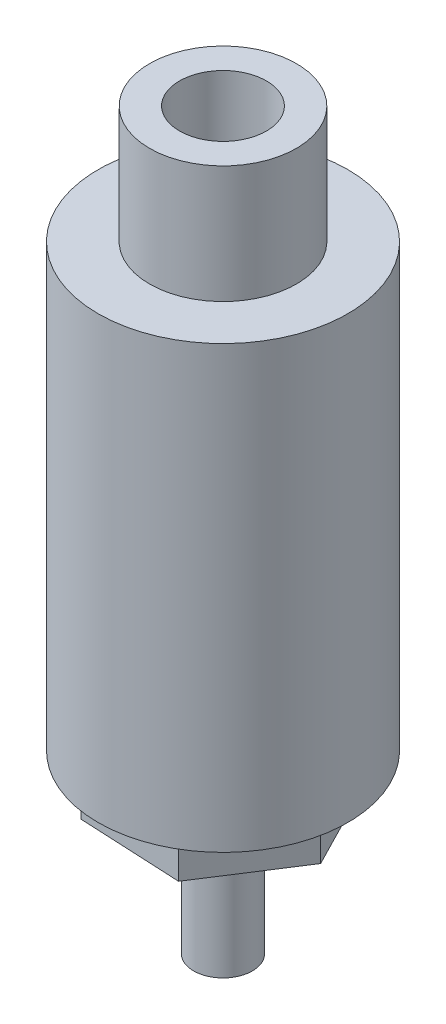
ISO-10303-21;
HEADER;
FILE_DESCRIPTION(('STEP AP214'),'2;1');
FILE_NAME('part.step','',(''),(''),'','','');
FILE_SCHEMA(('AUTOMOTIVE_DESIGN { 1 0 10303 214 1 1 1 1 }'));
ENDSEC;
DATA;
#1=APPLICATION_CONTEXT('core data for automotive mechanical design processes');
#2=APPLICATION_PROTOCOL_DEFINITION('international standard','automotive_design',2000,#1);
#3=PRODUCT_CONTEXT('',#1,'mechanical');
#4=PRODUCT('Part','Part','',(#3));
#5=PRODUCT_RELATED_PRODUCT_CATEGORY('part','',(#4));
#6=PRODUCT_DEFINITION_FORMATION('','',#4);
#7=PRODUCT_DEFINITION_CONTEXT('part definition',#1,'design');
#8=PRODUCT_DEFINITION('design','',#6,#7);
#9=PRODUCT_DEFINITION_SHAPE('','',#8);
#10=(LENGTH_UNIT() NAMED_UNIT(*) SI_UNIT(.MILLI.,.METRE.));
#11=(NAMED_UNIT(*) PLANE_ANGLE_UNIT() SI_UNIT($,.RADIAN.));
#12=(NAMED_UNIT(*) SI_UNIT($,.STERADIAN.) SOLID_ANGLE_UNIT());
#13=UNCERTAINTY_MEASURE_WITH_UNIT(LENGTH_MEASURE(1.E-05),#10,'distance_accuracy_value','');
#14=(GEOMETRIC_REPRESENTATION_CONTEXT(3) GLOBAL_UNCERTAINTY_ASSIGNED_CONTEXT((#13)) GLOBAL_UNIT_ASSIGNED_CONTEXT((#10,
#11,#12)) REPRESENTATION_CONTEXT('',''));
#15=CARTESIAN_POINT('',(0.,0.,0.));
#16=DIRECTION('',(0.,0.,1.));
#17=DIRECTION('',(1.,0.,0.));
#18=AXIS2_PLACEMENT_3D('',#15,#16,#17);
#19=CARTESIAN_POINT('',(8.5,0.,0.));
#20=DIRECTION('',(0.,1.,0.));
#21=DIRECTION('',(0.,0.,1.));
#22=AXIS2_PLACEMENT_3D('',#19,#20,#21);
#23=PLANE('',#22);
#24=CARTESIAN_POINT('',(0.,0.,0.));
#25=DIRECTION('',(0.,-1.,0.));
#26=DIRECTION('',(0.,0.,-1.));
#27=AXIS2_PLACEMENT_3D('',#24,#25,#26);
#28=CIRCLE('',#27,8.5);
#29=CARTESIAN_POINT('',(0.,0.,-8.5));
#30=VERTEX_POINT('',#29);
#31=EDGE_CURVE('E11',#30,#30,#28,.T.);
#32=ORIENTED_EDGE('',*,*,#31,.F.);
#33=EDGE_LOOP('',(#32));
#34=FACE_BOUND('',#33,.T.);
#35=CARTESIAN_POINT('',(0.,0.,0.));
#36=DIRECTION('',(0.,1.,0.));
#37=DIRECTION('',(0.,0.,1.));
#38=AXIS2_PLACEMENT_3D('',#35,#36,#37);
#39=CIRCLE('',#38,5.);
#40=CARTESIAN_POINT('',(0.,0.,5.));
#41=VERTEX_POINT('',#40);
#42=EDGE_CURVE('E220',#41,#41,#39,.T.);
#43=ORIENTED_EDGE('',*,*,#42,.F.);
#44=EDGE_LOOP('',(#43));
#45=FACE_BOUND('',#44,.T.);
#46=ADVANCED_FACE('F33',(#34,#45),#23,.T.);
#47=CARTESIAN_POINT('',(0.,-30.,0.));
#48=DIRECTION('',(0.,-1.,0.));
#49=DIRECTION('',(0.,0.,-1.));
#50=AXIS2_PLACEMENT_3D('',#47,#48,#49);
#51=PLANE('',#50);
#52=CARTESIAN_POINT('',(0.,-30.,0.));
#53=DIRECTION('',(0.,-1.,0.));
#54=DIRECTION('',(0.,0.,-1.));
#55=AXIS2_PLACEMENT_3D('',#52,#53,#54);
#56=CIRCLE('',#55,8.5);
#57=CARTESIAN_POINT('',(0.,-30.,-8.5));
#58=VERTEX_POINT('',#57);
#59=EDGE_CURVE('E41',#58,#58,#56,.T.);
#60=ORIENTED_EDGE('',*,*,#59,.T.);
#61=EDGE_LOOP('',(#60));
#62=FACE_BOUND('',#61,.T.);
#63=DIRECTION('',(0.541810394297245,0.,-0.840500741600782));
#64=VECTOR('',#63,1.);
#65=CARTESIAN_POINT('',(-3.19892857884121,-30.,-6.22630355407388));
#66=LINE('',#65,#64);
#67=CARTESIAN_POINT('',(-6.99160133892192,-30.,-0.342798362868405));
#68=VERTEX_POINT('',#67);
#69=CARTESIAN_POINT('',(-3.19892857884121,-30.,-6.22630355407388));
#70=VERTEX_POINT('',#69);
#71=EDGE_CURVE('E122',#68,#70,#66,.T.);
#72=ORIENTED_EDGE('',*,*,#71,.F.);
#73=DIRECTION('',(-0.456989796977315,0.,-0.889471936296268));
#74=VECTOR('',#73,1.);
#75=CARTESIAN_POINT('',(-6.99160133892192,-30.,-0.342798362868405));
#76=LINE('',#75,#74);
#77=CARTESIAN_POINT('',(-3.79267276008071,-30.,5.88350519120548));
#78=VERTEX_POINT('',#77);
#79=EDGE_CURVE('E119',#78,#68,#76,.T.);
#80=ORIENTED_EDGE('',*,*,#79,.F.);
#81=DIRECTION('',(-0.99880019127456,0.,-0.0489711946954855));
#82=VECTOR('',#81,1.);
#83=CARTESIAN_POINT('',(-3.79267276008071,-30.,5.88350519120548));
#84=LINE('',#83,#82);
#85=CARTESIAN_POINT('',(3.19892857884121,-30.,6.22630355407388));
#86=VERTEX_POINT('',#85);
#87=EDGE_CURVE('E77',#86,#78,#84,.T.);
#88=ORIENTED_EDGE('',*,*,#87,.F.);
#89=DIRECTION('',(-0.541810394297244,0.,0.840500741600782));
#90=VECTOR('',#89,1.);
#91=CARTESIAN_POINT('',(3.19892857884121,-30.,6.22630355407388));
#92=LINE('',#91,#90);
#93=CARTESIAN_POINT('',(6.99160133892192,-30.,0.342798362868401));
#94=VERTEX_POINT('',#93);
#95=EDGE_CURVE('E128',#94,#86,#92,.T.);
#96=ORIENTED_EDGE('',*,*,#95,.F.);
#97=DIRECTION('',(0.456989796977315,0.,0.889471936296268));
#98=VECTOR('',#97,1.);
#99=CARTESIAN_POINT('',(6.99160133892192,-30.,0.342798362868401));
#100=LINE('',#99,#98);
#101=CARTESIAN_POINT('',(3.79267276008071,-30.,-5.88350519120548));
#102=VERTEX_POINT('',#101);
#103=EDGE_CURVE('E108',#102,#94,#100,.T.);
#104=ORIENTED_EDGE('',*,*,#103,.F.);
#105=DIRECTION('',(0.99880019127456,0.,0.0489711946954854));
#106=VECTOR('',#105,1.);
#107=CARTESIAN_POINT('',(3.79267276008071,-30.,-5.88350519120548));
#108=LINE('',#107,#106);
#109=EDGE_CURVE('E125',#70,#102,#108,.T.);
#110=ORIENTED_EDGE('',*,*,#109,.F.);
#111=EDGE_LOOP('',(#72,#80,#88,#96,#104,#110));
#112=FACE_BOUND('',#111,.T.);
#113=ADVANCED_FACE('F142',(#62,#112),#51,.T.);
#114=CARTESIAN_POINT('',(0.,0.,0.));
#115=DIRECTION('',(0.,-1.,0.));
#116=DIRECTION('',(0.,0.,-1.));
#117=AXIS2_PLACEMENT_3D('',#114,#115,#116);
#118=CYLINDRICAL_SURFACE('',#117,8.5);
#119=ORIENTED_EDGE('',*,*,#31,.T.);
#120=EDGE_LOOP('',(#119));
#121=FACE_BOUND('',#120,.T.);
#122=ORIENTED_EDGE('',*,*,#59,.F.);
#123=EDGE_LOOP('',(#122));
#124=FACE_BOUND('',#123,.T.);
#125=ADVANCED_FACE('F35',(#121,#124),#118,.T.);
#126=CARTESIAN_POINT('',(-6.99160133892192,-33.,-0.342798362868405));
#127=DIRECTION('',(0.889471936296268,0.,-0.456989796977315));
#128=DIRECTION('',(-0.456989796977315,0.,-0.889471936296268));
#129=AXIS2_PLACEMENT_3D('',#126,#127,#128);
#130=PLANE('',#129);
#131=ORIENTED_EDGE('',*,*,#79,.T.);
#132=DIRECTION('',(0.,1.,0.));
#133=VECTOR('',#132,1.);
#134=CARTESIAN_POINT('',(-6.99160133892192,-33.,-0.342798362868405));
#135=LINE('',#134,#133);
#136=CARTESIAN_POINT('',(-6.99160133892192,-33.,-0.342798362868405));
#137=VERTEX_POINT('',#136);
#138=EDGE_CURVE('E138',#137,#68,#135,.T.);
#139=ORIENTED_EDGE('',*,*,#138,.F.);
#140=DIRECTION('',(-0.456989796977315,0.,-0.889471936296268));
#141=VECTOR('',#140,1.);
#142=CARTESIAN_POINT('',(-6.99160133892192,-33.,-0.342798362868405));
#143=LINE('',#142,#141);
#144=CARTESIAN_POINT('',(-3.79267276008071,-33.,5.88350519120548));
#145=VERTEX_POINT('',#144);
#146=EDGE_CURVE('E131',#145,#137,#143,.T.);
#147=ORIENTED_EDGE('',*,*,#146,.F.);
#148=DIRECTION('',(0.,1.,0.));
#149=VECTOR('',#148,1.);
#150=CARTESIAN_POINT('',(-3.79267276008071,-33.,5.88350519120548));
#151=LINE('',#150,#149);
#152=EDGE_CURVE('E115',#145,#78,#151,.T.);
#153=ORIENTED_EDGE('',*,*,#152,.T.);
#154=EDGE_LOOP('',(#131,#139,#147,#153));
#155=FACE_BOUND('',#154,.T.);
#156=ADVANCED_FACE('F146',(#155),#130,.F.);
#157=CARTESIAN_POINT('',(-3.19892857884121,-33.,-6.22630355407388));
#158=DIRECTION('',(0.840500741600782,0.,0.541810394297245));
#159=DIRECTION('',(0.541810394297245,0.,-0.840500741600782));
#160=AXIS2_PLACEMENT_3D('',#157,#158,#159);
#161=PLANE('',#160);
#162=ORIENTED_EDGE('',*,*,#71,.T.);
#163=DIRECTION('',(0.,1.,0.));
#164=VECTOR('',#163,1.);
#165=CARTESIAN_POINT('',(-3.19892857884121,-33.,-6.22630355407388));
#166=LINE('',#165,#164);
#167=CARTESIAN_POINT('',(-3.19892857884121,-33.,-6.22630355407388));
#168=VERTEX_POINT('',#167);
#169=EDGE_CURVE('E135',#168,#70,#166,.T.);
#170=ORIENTED_EDGE('',*,*,#169,.F.);
#171=DIRECTION('',(0.541810394297245,0.,-0.840500741600782));
#172=VECTOR('',#171,1.);
#173=CARTESIAN_POINT('',(-3.19892857884121,-33.,-6.22630355407388));
#174=LINE('',#173,#172);
#175=EDGE_CURVE('E85',#137,#168,#174,.T.);
#176=ORIENTED_EDGE('',*,*,#175,.F.);
#177=ORIENTED_EDGE('',*,*,#138,.T.);
#178=EDGE_LOOP('',(#162,#170,#176,#177));
#179=FACE_BOUND('',#178,.T.);
#180=ADVANCED_FACE('F152',(#179),#161,.F.);
#181=CARTESIAN_POINT('',(3.79267276008071,-33.,-5.88350519120548));
#182=DIRECTION('',(-0.0489711946954854,0.,0.99880019127456));
#183=DIRECTION('',(0.99880019127456,0.,0.0489711946954854));
#184=AXIS2_PLACEMENT_3D('',#181,#182,#183);
#185=PLANE('',#184);
#186=ORIENTED_EDGE('',*,*,#109,.T.);
#187=DIRECTION('',(0.,1.,0.));
#188=VECTOR('',#187,1.);
#189=CARTESIAN_POINT('',(3.79267276008071,-33.,-5.88350519120548));
#190=LINE('',#189,#188);
#191=CARTESIAN_POINT('',(3.79267276008071,-33.,-5.88350519120548));
#192=VERTEX_POINT('',#191);
#193=EDGE_CURVE('E111',#192,#102,#190,.T.);
#194=ORIENTED_EDGE('',*,*,#193,.F.);
#195=DIRECTION('',(0.99880019127456,0.,0.0489711946954854));
#196=VECTOR('',#195,1.);
#197=CARTESIAN_POINT('',(3.79267276008071,-33.,-5.88350519120548));
#198=LINE('',#197,#196);
#199=EDGE_CURVE('E99',#168,#192,#198,.T.);
#200=ORIENTED_EDGE('',*,*,#199,.F.);
#201=ORIENTED_EDGE('',*,*,#169,.T.);
#202=EDGE_LOOP('',(#186,#194,#200,#201));
#203=FACE_BOUND('',#202,.T.);
#204=ADVANCED_FACE('F165',(#203),#185,.F.);
#205=CARTESIAN_POINT('',(6.99160133892192,-33.,0.342798362868401));
#206=DIRECTION('',(-0.889471936296268,0.,0.456989796977315));
#207=DIRECTION('',(0.456989796977315,0.,0.889471936296268));
#208=AXIS2_PLACEMENT_3D('',#205,#206,#207);
#209=PLANE('',#208);
#210=ORIENTED_EDGE('',*,*,#103,.T.);
#211=DIRECTION('',(0.,1.,0.));
#212=VECTOR('',#211,1.);
#213=CARTESIAN_POINT('',(6.99160133892192,-33.,0.342798362868401));
#214=LINE('',#213,#212);
#215=CARTESIAN_POINT('',(6.99160133892192,-33.,0.342798362868401));
#216=VERTEX_POINT('',#215);
#217=EDGE_CURVE('E105',#216,#94,#214,.T.);
#218=ORIENTED_EDGE('',*,*,#217,.F.);
#219=DIRECTION('',(0.456989796977315,0.,0.889471936296268));
#220=VECTOR('',#219,1.);
#221=CARTESIAN_POINT('',(6.99160133892192,-33.,0.342798362868401));
#222=LINE('',#221,#220);
#223=EDGE_CURVE('E93',#192,#216,#222,.T.);
#224=ORIENTED_EDGE('',*,*,#223,.F.);
#225=ORIENTED_EDGE('',*,*,#193,.T.);
#226=EDGE_LOOP('',(#210,#218,#224,#225));
#227=FACE_BOUND('',#226,.T.);
#228=ADVANCED_FACE('F106',(#227),#209,.F.);
#229=CARTESIAN_POINT('',(3.19892857884121,-33.,6.22630355407388));
#230=DIRECTION('',(-0.840500741600782,0.,-0.541810394297244));
#231=DIRECTION('',(-0.541810394297244,0.,0.840500741600782));
#232=AXIS2_PLACEMENT_3D('',#229,#230,#231);
#233=PLANE('',#232);
#234=ORIENTED_EDGE('',*,*,#95,.T.);
#235=DIRECTION('',(0.,1.,0.));
#236=VECTOR('',#235,1.);
#237=CARTESIAN_POINT('',(3.19892857884121,-33.,6.22630355407388));
#238=LINE('',#237,#236);
#239=CARTESIAN_POINT('',(3.19892857884121,-33.,6.22630355407388));
#240=VERTEX_POINT('',#239);
#241=EDGE_CURVE('E48',#240,#86,#238,.T.);
#242=ORIENTED_EDGE('',*,*,#241,.F.);
#243=DIRECTION('',(-0.541810394297244,0.,0.840500741600782));
#244=VECTOR('',#243,1.);
#245=CARTESIAN_POINT('',(3.19892857884121,-33.,6.22630355407388));
#246=LINE('',#245,#244);
#247=EDGE_CURVE('E97',#216,#240,#246,.T.);
#248=ORIENTED_EDGE('',*,*,#247,.F.);
#249=ORIENTED_EDGE('',*,*,#217,.T.);
#250=EDGE_LOOP('',(#234,#242,#248,#249));
#251=FACE_BOUND('',#250,.T.);
#252=ADVANCED_FACE('F113',(#251),#233,.F.);
#253=CARTESIAN_POINT('',(-3.79267276008071,-33.,5.88350519120548));
#254=DIRECTION('',(0.0489711946954855,0.,-0.99880019127456));
#255=DIRECTION('',(-0.99880019127456,0.,-0.0489711946954855));
#256=AXIS2_PLACEMENT_3D('',#253,#254,#255);
#257=PLANE('',#256);
#258=ORIENTED_EDGE('',*,*,#87,.T.);
#259=ORIENTED_EDGE('',*,*,#152,.F.);
#260=DIRECTION('',(-0.99880019127456,0.,-0.0489711946954855));
#261=VECTOR('',#260,1.);
#262=CARTESIAN_POINT('',(-3.79267276008071,-33.,5.88350519120548));
#263=LINE('',#262,#261);
#264=EDGE_CURVE('E56',#240,#145,#263,.T.);
#265=ORIENTED_EDGE('',*,*,#264,.F.);
#266=ORIENTED_EDGE('',*,*,#241,.T.);
#267=EDGE_LOOP('',(#258,#259,#265,#266));
#268=FACE_BOUND('',#267,.T.);
#269=ADVANCED_FACE('F173',(#268),#257,.F.);
#270=CARTESIAN_POINT('',(0.,-33.,0.));
#271=DIRECTION('',(0.,1.,0.));
#272=DIRECTION('',(0.,0.,1.));
#273=AXIS2_PLACEMENT_3D('',#270,#271,#272);
#274=PLANE('',#273);
#275=CARTESIAN_POINT('',(0.,-33.,0.));
#276=DIRECTION('',(0.,-1.,0.));
#277=DIRECTION('',(0.,0.,-1.));
#278=AXIS2_PLACEMENT_3D('',#275,#276,#277);
#279=CIRCLE('',#278,2.);
#280=CARTESIAN_POINT('',(0.,-33.,-2.));
#281=VERTEX_POINT('',#280);
#282=EDGE_CURVE('E217',#281,#281,#279,.T.);
#283=ORIENTED_EDGE('',*,*,#282,.F.);
#284=EDGE_LOOP('',(#283));
#285=FACE_BOUND('',#284,.T.);
#286=ORIENTED_EDGE('',*,*,#146,.T.);
#287=ORIENTED_EDGE('',*,*,#175,.T.);
#288=ORIENTED_EDGE('',*,*,#199,.T.);
#289=ORIENTED_EDGE('',*,*,#223,.T.);
#290=ORIENTED_EDGE('',*,*,#247,.T.);
#291=ORIENTED_EDGE('',*,*,#264,.T.);
#292=EDGE_LOOP('',(#286,#287,#288,#289,#290,#291));
#293=FACE_BOUND('',#292,.T.);
#294=ADVANCED_FACE('F95',(#285,#293),#274,.F.);
#295=CARTESIAN_POINT('',(0.,8.,0.));
#296=DIRECTION('',(0.,-1.,0.));
#297=DIRECTION('',(0.,0.,-1.));
#298=AXIS2_PLACEMENT_3D('',#295,#296,#297);
#299=CYLINDRICAL_SURFACE('',#298,5.);
#300=CARTESIAN_POINT('',(0.,8.,0.));
#301=DIRECTION('',(0.,1.,0.));
#302=DIRECTION('',(0.,0.,1.));
#303=AXIS2_PLACEMENT_3D('',#300,#301,#302);
#304=CIRCLE('',#303,5.);
#305=CARTESIAN_POINT('',(0.,8.,5.));
#306=VERTEX_POINT('',#305);
#307=EDGE_CURVE('E123',#306,#306,#304,.T.);
#308=ORIENTED_EDGE('',*,*,#307,.F.);
#309=EDGE_LOOP('',(#308));
#310=FACE_BOUND('',#309,.T.);
#311=ORIENTED_EDGE('',*,*,#42,.T.);
#312=EDGE_LOOP('',(#311));
#313=FACE_BOUND('',#312,.T.);
#314=ADVANCED_FACE('F178',(#310,#313),#299,.T.);
#315=CARTESIAN_POINT('',(0.,8.,0.));
#316=DIRECTION('',(0.,1.,0.));
#317=DIRECTION('',(0.,0.,1.));
#318=AXIS2_PLACEMENT_3D('',#315,#316,#317);
#319=PLANE('',#318);
#320=CARTESIAN_POINT('',(0.,8.,0.));
#321=DIRECTION('',(0.,1.,0.));
#322=DIRECTION('',(0.,0.,1.));
#323=AXIS2_PLACEMENT_3D('',#320,#321,#322);
#324=CIRCLE('',#323,2.9585);
#325=CARTESIAN_POINT('',(0.,8.,2.9585));
#326=VERTEX_POINT('',#325);
#327=EDGE_CURVE('E210',#326,#326,#324,.T.);
#328=ORIENTED_EDGE('',*,*,#327,.F.);
#329=EDGE_LOOP('',(#328));
#330=FACE_BOUND('',#329,.T.);
#331=ORIENTED_EDGE('',*,*,#307,.T.);
#332=EDGE_LOOP('',(#331));
#333=FACE_BOUND('',#332,.T.);
#334=ADVANCED_FACE('F182',(#330,#333),#319,.T.);
#335=CARTESIAN_POINT('',(0.,-33.,0.));
#336=DIRECTION('',(0.,-1.,0.));
#337=DIRECTION('',(0.,0.,-1.));
#338=AXIS2_PLACEMENT_3D('',#335,#336,#337);
#339=CYLINDRICAL_SURFACE('',#338,2.);
#340=ORIENTED_EDGE('',*,*,#282,.T.);
#341=EDGE_LOOP('',(#340));
#342=FACE_BOUND('',#341,.T.);
#343=CARTESIAN_POINT('',(0.,-42.,0.));
#344=DIRECTION('',(0.,-1.,0.));
#345=DIRECTION('',(0.,0.,-1.));
#346=AXIS2_PLACEMENT_3D('',#343,#344,#345);
#347=CIRCLE('',#346,2.);
#348=CARTESIAN_POINT('',(0.,-42.,-2.));
#349=VERTEX_POINT('',#348);
#350=EDGE_CURVE('E212',#349,#349,#347,.T.);
#351=ORIENTED_EDGE('',*,*,#350,.F.);
#352=EDGE_LOOP('',(#351));
#353=FACE_BOUND('',#352,.T.);
#354=ADVANCED_FACE('F186',(#342,#353),#339,.T.);
#355=CARTESIAN_POINT('',(0.,-42.,0.));
#356=DIRECTION('',(0.,-1.,0.));
#357=DIRECTION('',(0.,0.,-1.));
#358=AXIS2_PLACEMENT_3D('',#355,#356,#357);
#359=PLANE('',#358);
#360=ORIENTED_EDGE('',*,*,#350,.T.);
#361=EDGE_LOOP('',(#360));
#362=FACE_BOUND('',#361,.T.);
#363=ADVANCED_FACE('F190',(#362),#359,.T.);
#364=CARTESIAN_POINT('',(0.,-6.,0.));
#365=DIRECTION('',(0.,1.,0.));
#366=DIRECTION('',(0.,0.,1.));
#367=AXIS2_PLACEMENT_3D('',#364,#365,#366);
#368=CONICAL_SURFACE('',#367,2.9585,1.02974425865803);
#369=CARTESIAN_POINT('',(0.,-7.77764614146804,0.));
#370=VERTEX_POINT('',#369);
#371=VERTEX_LOOP('',#370);
#372=FACE_BOUND('',#371,.T.);
#373=CARTESIAN_POINT('',(0.,-6.,0.));
#374=DIRECTION('',(0.,1.,0.));
#375=DIRECTION('',(0.,0.,1.));
#376=AXIS2_PLACEMENT_3D('',#373,#374,#375);
#377=CIRCLE('',#376,2.9585);
#378=CARTESIAN_POINT('',(0.,-6.,2.9585));
#379=VERTEX_POINT('',#378);
#380=EDGE_CURVE('E207',#379,#379,#377,.T.);
#381=ORIENTED_EDGE('',*,*,#380,.T.);
#382=EDGE_LOOP('',(#381));
#383=FACE_BOUND('',#382,.T.);
#384=ADVANCED_FACE('F194',(#372,#383),#368,.F.);
#385=CARTESIAN_POINT('',(0.,8.,0.));
#386=DIRECTION('',(0.,1.,0.));
#387=DIRECTION('',(0.,0.,1.));
#388=AXIS2_PLACEMENT_3D('',#385,#386,#387);
#389=CYLINDRICAL_SURFACE('',#388,2.9585);
#390=ORIENTED_EDGE('',*,*,#380,.F.);
#391=EDGE_LOOP('',(#390));
#392=FACE_BOUND('',#391,.T.);
#393=ORIENTED_EDGE('',*,*,#327,.T.);
#394=EDGE_LOOP('',(#393));
#395=FACE_BOUND('',#394,.T.);
#396=ADVANCED_FACE('F198',(#392,#395),#389,.F.);
#397=CLOSED_SHELL('',(#46,#113,#125,#156,#180,#204,#228,#252,#269,#294,#314,#334,#354,#363,#384,#396));
#398=MANIFOLD_SOLID_BREP('B2',#397);
#399=ADVANCED_BREP_SHAPE_REPRESENTATION('',(#18,#398),#14);
#400=SHAPE_DEFINITION_REPRESENTATION(#9,#399);
ENDSEC;
END-ISO-10303-21;
